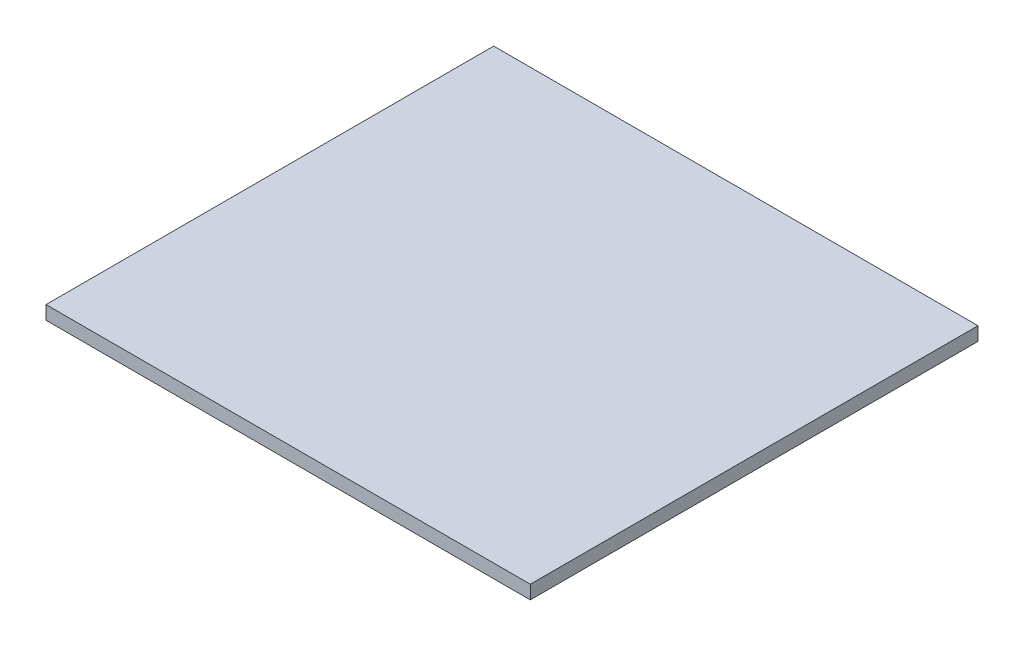
ISO-10303-21;
HEADER;
FILE_DESCRIPTION(('STEP AP214'),'2;1');
FILE_NAME('part.step','',(''),(''),'','','');
FILE_SCHEMA(('AUTOMOTIVE_DESIGN { 1 0 10303 214 1 1 1 1 }'));
ENDSEC;
DATA;
#1=APPLICATION_CONTEXT('core data for automotive mechanical design processes');
#2=APPLICATION_PROTOCOL_DEFINITION('international standard','automotive_design',2000,#1);
#3=PRODUCT_CONTEXT('',#1,'mechanical');
#4=PRODUCT('Part','Part','',(#3));
#5=PRODUCT_RELATED_PRODUCT_CATEGORY('part','',(#4));
#6=PRODUCT_DEFINITION_FORMATION('','',#4);
#7=PRODUCT_DEFINITION_CONTEXT('part definition',#1,'design');
#8=PRODUCT_DEFINITION('design','',#6,#7);
#9=PRODUCT_DEFINITION_SHAPE('','',#8);
#10=(LENGTH_UNIT() NAMED_UNIT(*) SI_UNIT(.MILLI.,.METRE.));
#11=(NAMED_UNIT(*) PLANE_ANGLE_UNIT() SI_UNIT($,.RADIAN.));
#12=(NAMED_UNIT(*) SI_UNIT($,.STERADIAN.) SOLID_ANGLE_UNIT());
#13=UNCERTAINTY_MEASURE_WITH_UNIT(LENGTH_MEASURE(1.E-05),#10,'distance_accuracy_value','');
#14=(GEOMETRIC_REPRESENTATION_CONTEXT(3) GLOBAL_UNCERTAINTY_ASSIGNED_CONTEXT((#13)) GLOBAL_UNIT_ASSIGNED_CONTEXT((#10,
#11,#12)) REPRESENTATION_CONTEXT('',''));
#15=CARTESIAN_POINT('',(0.,0.,0.));
#16=DIRECTION('',(0.,0.,1.));
#17=DIRECTION('',(1.,0.,0.));
#18=AXIS2_PLACEMENT_3D('',#15,#16,#17);
#19=CARTESIAN_POINT('',(-44.2815420560747,3.,-20.6980140186916));
#20=DIRECTION('',(1.,0.,0.));
#21=DIRECTION('',(0.,0.,-1.));
#22=AXIS2_PLACEMENT_3D('',#19,#20,#21);
#23=PLANE('',#22);
#24=DIRECTION('',(0.,0.,1.));
#25=VECTOR('',#24,1.);
#26=CARTESIAN_POINT('',(-44.2815420560747,0.,-20.6980140186916));
#27=LINE('',#26,#25);
#28=CARTESIAN_POINT('',(-44.2815420560747,0.,-20.6980140186916));
#29=VERTEX_POINT('',#28);
#30=CARTESIAN_POINT('',(-44.2815420560747,0.,78.1019859813084));
#31=VERTEX_POINT('',#30);
#32=EDGE_CURVE('E96',#29,#31,#27,.T.);
#33=ORIENTED_EDGE('',*,*,#32,.T.);
#34=DIRECTION('',(0.,-1.,0.));
#35=VECTOR('',#34,1.);
#36=CARTESIAN_POINT('',(-44.2815420560747,3.,78.1019859813084));
#37=LINE('',#36,#35);
#38=CARTESIAN_POINT('',(-44.2815420560747,3.,78.1019859813084));
#39=VERTEX_POINT('',#38);
#40=EDGE_CURVE('E11',#39,#31,#37,.T.);
#41=ORIENTED_EDGE('',*,*,#40,.F.);
#42=DIRECTION('',(0.,0.,1.));
#43=VECTOR('',#42,1.);
#44=CARTESIAN_POINT('',(-44.2815420560747,3.,-20.6980140186916));
#45=LINE('',#44,#43);
#46=CARTESIAN_POINT('',(-44.2815420560747,3.,-20.6980140186916));
#47=VERTEX_POINT('',#46);
#48=EDGE_CURVE('E84',#47,#39,#45,.T.);
#49=ORIENTED_EDGE('',*,*,#48,.F.);
#50=DIRECTION('',(0.,-1.,0.));
#51=VECTOR('',#50,1.);
#52=CARTESIAN_POINT('',(-44.2815420560747,3.,-20.6980140186916));
#53=LINE('',#52,#51);
#54=EDGE_CURVE('E92',#47,#29,#53,.T.);
#55=ORIENTED_EDGE('',*,*,#54,.T.);
#56=EDGE_LOOP('',(#33,#41,#49,#55));
#57=FACE_BOUND('',#56,.T.);
#58=ADVANCED_FACE('F33',(#57),#23,.F.);
#59=CARTESIAN_POINT('',(-44.2815420560747,3.,78.1019859813084));
#60=DIRECTION('',(0.,0.,-1.));
#61=DIRECTION('',(-1.,0.,0.));
#62=AXIS2_PLACEMENT_3D('',#59,#60,#61);
#63=PLANE('',#62);
#64=DIRECTION('',(1.,0.,0.));
#65=VECTOR('',#64,1.);
#66=CARTESIAN_POINT('',(-44.2815420560747,0.,78.1019859813084));
#67=LINE('',#66,#65);
#68=CARTESIAN_POINT('',(62.5984579439253,0.,78.1019859813084));
#69=VERTEX_POINT('',#68);
#70=EDGE_CURVE('E88',#31,#69,#67,.T.);
#71=ORIENTED_EDGE('',*,*,#70,.T.);
#72=DIRECTION('',(0.,-1.,0.));
#73=VECTOR('',#72,1.);
#74=CARTESIAN_POINT('',(62.5984579439253,3.,78.1019859813084));
#75=LINE('',#74,#73);
#76=CARTESIAN_POINT('',(62.5984579439253,3.,78.1019859813084));
#77=VERTEX_POINT('',#76);
#78=EDGE_CURVE('E41',#77,#69,#75,.T.);
#79=ORIENTED_EDGE('',*,*,#78,.F.);
#80=DIRECTION('',(1.,0.,0.));
#81=VECTOR('',#80,1.);
#82=CARTESIAN_POINT('',(-44.2815420560747,3.,78.1019859813084));
#83=LINE('',#82,#81);
#84=EDGE_CURVE('E79',#39,#77,#83,.T.);
#85=ORIENTED_EDGE('',*,*,#84,.F.);
#86=ORIENTED_EDGE('',*,*,#40,.T.);
#87=EDGE_LOOP('',(#71,#79,#85,#86));
#88=FACE_BOUND('',#87,.T.);
#89=ADVANCED_FACE('F87',(#88),#63,.F.);
#90=CARTESIAN_POINT('',(62.5984579439252,3.,-20.6980140186916));
#91=DIRECTION('',(-1.,0.,0.));
#92=DIRECTION('',(0.,0.,1.));
#93=AXIS2_PLACEMENT_3D('',#90,#91,#92);
#94=PLANE('',#93);
#95=DIRECTION('',(0.,0.,-1.));
#96=VECTOR('',#95,1.);
#97=CARTESIAN_POINT('',(62.5984579439252,0.,-20.6980140186916));
#98=LINE('',#97,#96);
#99=CARTESIAN_POINT('',(62.5984579439252,0.,-20.6980140186916));
#100=VERTEX_POINT('',#99);
#101=EDGE_CURVE('E66',#69,#100,#98,.T.);
#102=ORIENTED_EDGE('',*,*,#101,.T.);
#103=DIRECTION('',(0.,-1.,0.));
#104=VECTOR('',#103,1.);
#105=CARTESIAN_POINT('',(62.5984579439252,3.,-20.6980140186916));
#106=LINE('',#105,#104);
#107=CARTESIAN_POINT('',(62.5984579439252,3.,-20.6980140186916));
#108=VERTEX_POINT('',#107);
#109=EDGE_CURVE('E89',#108,#100,#106,.T.);
#110=ORIENTED_EDGE('',*,*,#109,.F.);
#111=DIRECTION('',(0.,0.,-1.));
#112=VECTOR('',#111,1.);
#113=CARTESIAN_POINT('',(62.5984579439252,3.,-20.6980140186916));
#114=LINE('',#113,#112);
#115=EDGE_CURVE('E82',#77,#108,#114,.T.);
#116=ORIENTED_EDGE('',*,*,#115,.F.);
#117=ORIENTED_EDGE('',*,*,#78,.T.);
#118=EDGE_LOOP('',(#102,#110,#116,#117));
#119=FACE_BOUND('',#118,.T.);
#120=ADVANCED_FACE('F90',(#119),#94,.F.);
#121=CARTESIAN_POINT('',(-44.2815420560747,3.,-20.6980140186916));
#122=DIRECTION('',(0.,0.,1.));
#123=DIRECTION('',(1.,0.,0.));
#124=AXIS2_PLACEMENT_3D('',#121,#122,#123);
#125=PLANE('',#124);
#126=DIRECTION('',(-1.,0.,0.));
#127=VECTOR('',#126,1.);
#128=CARTESIAN_POINT('',(-44.2815420560747,0.,-20.6980140186916));
#129=LINE('',#128,#127);
#130=EDGE_CURVE('E72',#100,#29,#129,.T.);
#131=ORIENTED_EDGE('',*,*,#130,.T.);
#132=ORIENTED_EDGE('',*,*,#54,.F.);
#133=DIRECTION('',(-1.,0.,0.));
#134=VECTOR('',#133,1.);
#135=CARTESIAN_POINT('',(-44.2815420560747,3.,-20.6980140186916));
#136=LINE('',#135,#134);
#137=EDGE_CURVE('E49',#108,#47,#136,.T.);
#138=ORIENTED_EDGE('',*,*,#137,.F.);
#139=ORIENTED_EDGE('',*,*,#109,.T.);
#140=EDGE_LOOP('',(#131,#132,#138,#139));
#141=FACE_BOUND('',#140,.T.);
#142=ADVANCED_FACE('F103',(#141),#125,.F.);
#143=CARTESIAN_POINT('',(0.,3.,0.));
#144=DIRECTION('',(0.,1.,0.));
#145=DIRECTION('',(0.,0.,1.));
#146=AXIS2_PLACEMENT_3D('',#143,#144,#145);
#147=PLANE('',#146);
#148=ORIENTED_EDGE('',*,*,#48,.T.);
#149=ORIENTED_EDGE('',*,*,#84,.T.);
#150=ORIENTED_EDGE('',*,*,#115,.T.);
#151=ORIENTED_EDGE('',*,*,#137,.T.);
#152=EDGE_LOOP('',(#148,#149,#150,#151));
#153=FACE_BOUND('',#152,.T.);
#154=ADVANCED_FACE('F80',(#153),#147,.T.);
#155=CARTESIAN_POINT('',(0.,0.,0.));
#156=DIRECTION('',(0.,1.,0.));
#157=DIRECTION('',(0.,0.,1.));
#158=AXIS2_PLACEMENT_3D('',#155,#156,#157);
#159=PLANE('',#158);
#160=ORIENTED_EDGE('',*,*,#32,.F.);
#161=ORIENTED_EDGE('',*,*,#130,.F.);
#162=ORIENTED_EDGE('',*,*,#101,.F.);
#163=ORIENTED_EDGE('',*,*,#70,.F.);
#164=EDGE_LOOP('',(#160,#161,#162,#163));
#165=FACE_BOUND('',#164,.T.);
#166=ADVANCED_FACE('F106',(#165),#159,.F.);
#167=CLOSED_SHELL('',(#58,#89,#120,#142,#154,#166));
#168=MANIFOLD_SOLID_BREP('B2',#167);
#169=ADVANCED_BREP_SHAPE_REPRESENTATION('',(#18,#168),#14);
#170=SHAPE_DEFINITION_REPRESENTATION(#9,#169);
ENDSEC;
END-ISO-10303-21;
